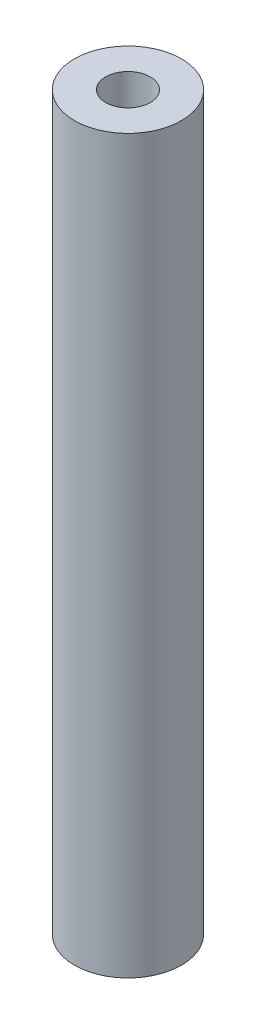
ISO-10303-21;
HEADER;
FILE_DESCRIPTION(('STEP AP214'),'2;1');
FILE_NAME('part.step','',(''),(''),'','','');
FILE_SCHEMA(('AUTOMOTIVE_DESIGN { 1 0 10303 214 1 1 1 1 }'));
ENDSEC;
DATA;
#1=APPLICATION_CONTEXT('core data for automotive mechanical design processes');
#2=APPLICATION_PROTOCOL_DEFINITION('international standard','automotive_design',2000,#1);
#3=PRODUCT_CONTEXT('',#1,'mechanical');
#4=PRODUCT('Part','Part','',(#3));
#5=PRODUCT_RELATED_PRODUCT_CATEGORY('part','',(#4));
#6=PRODUCT_DEFINITION_FORMATION('','',#4);
#7=PRODUCT_DEFINITION_CONTEXT('part definition',#1,'design');
#8=PRODUCT_DEFINITION('design','',#6,#7);
#9=PRODUCT_DEFINITION_SHAPE('','',#8);
#10=(LENGTH_UNIT() NAMED_UNIT(*) SI_UNIT(.MILLI.,.METRE.));
#11=(NAMED_UNIT(*) PLANE_ANGLE_UNIT() SI_UNIT($,.RADIAN.));
#12=(NAMED_UNIT(*) SI_UNIT($,.STERADIAN.) SOLID_ANGLE_UNIT());
#13=UNCERTAINTY_MEASURE_WITH_UNIT(LENGTH_MEASURE(1.E-05),#10,'distance_accuracy_value','');
#14=(GEOMETRIC_REPRESENTATION_CONTEXT(3) GLOBAL_UNCERTAINTY_ASSIGNED_CONTEXT((#13)) GLOBAL_UNIT_ASSIGNED_CONTEXT((#10,
#11,#12)) REPRESENTATION_CONTEXT('',''));
#15=CARTESIAN_POINT('',(0.,0.,0.));
#16=DIRECTION('',(0.,0.,1.));
#17=DIRECTION('',(1.,0.,0.));
#18=AXIS2_PLACEMENT_3D('',#15,#16,#17);
#19=CARTESIAN_POINT('',(0.,41.,0.));
#20=DIRECTION('',(0.,-1.,0.));
#21=DIRECTION('',(0.,0.,-1.));
#22=AXIS2_PLACEMENT_3D('',#19,#20,#21);
#23=CYLINDRICAL_SURFACE('',#22,3.);
#24=CARTESIAN_POINT('',(0.,41.,0.));
#25=DIRECTION('',(0.,1.,0.));
#26=DIRECTION('',(0.,0.,1.));
#27=AXIS2_PLACEMENT_3D('',#24,#25,#26);
#28=CIRCLE('',#27,3.);
#29=CARTESIAN_POINT('',(0.,41.,3.));
#30=VERTEX_POINT('',#29);
#31=EDGE_CURVE('E11',#30,#30,#28,.T.);
#32=ORIENTED_EDGE('',*,*,#31,.F.);
#33=EDGE_LOOP('',(#32));
#34=FACE_BOUND('',#33,.T.);
#35=CARTESIAN_POINT('',(0.,0.,0.));
#36=DIRECTION('',(0.,1.,0.));
#37=DIRECTION('',(0.,0.,1.));
#38=AXIS2_PLACEMENT_3D('',#35,#36,#37);
#39=CIRCLE('',#38,3.);
#40=CARTESIAN_POINT('',(0.,0.,3.));
#41=VERTEX_POINT('',#40);
#42=EDGE_CURVE('E45',#41,#41,#39,.T.);
#43=ORIENTED_EDGE('',*,*,#42,.T.);
#44=EDGE_LOOP('',(#43));
#45=FACE_BOUND('',#44,.T.);
#46=ADVANCED_FACE('F42',(#34,#45),#23,.T.);
#47=CARTESIAN_POINT('',(0.,41.,0.));
#48=DIRECTION('',(0.,1.,0.));
#49=DIRECTION('',(0.,0.,1.));
#50=AXIS2_PLACEMENT_3D('',#47,#48,#49);
#51=PLANE('',#50);
#52=CARTESIAN_POINT('',(0.,41.,0.));
#53=DIRECTION('',(0.,1.,0.));
#54=DIRECTION('',(0.,0.,1.));
#55=AXIS2_PLACEMENT_3D('',#52,#53,#54);
#56=CIRCLE('',#55,1.24999999999999);
#57=CARTESIAN_POINT('',(0.,41.,1.24999999999999));
#58=VERTEX_POINT('',#57);
#59=EDGE_CURVE('E67',#58,#58,#56,.T.);
#60=ORIENTED_EDGE('',*,*,#59,.F.);
#61=EDGE_LOOP('',(#60));
#62=FACE_BOUND('',#61,.T.);
#63=ORIENTED_EDGE('',*,*,#31,.T.);
#64=EDGE_LOOP('',(#63));
#65=FACE_BOUND('',#64,.T.);
#66=ADVANCED_FACE('F90',(#62,#65),#51,.T.);
#67=CARTESIAN_POINT('',(0.,0.,0.));
#68=DIRECTION('',(0.,1.,0.));
#69=DIRECTION('',(0.,0.,1.));
#70=AXIS2_PLACEMENT_3D('',#67,#68,#69);
#71=PLANE('',#70);
#72=CARTESIAN_POINT('',(0.,0.,0.));
#73=DIRECTION('',(0.,-1.,0.));
#74=DIRECTION('',(0.,0.,-1.));
#75=AXIS2_PLACEMENT_3D('',#72,#73,#74);
#76=CIRCLE('',#75,1.24999999999999);
#77=CARTESIAN_POINT('',(0.,0.,-1.24999999999999));
#78=VERTEX_POINT('',#77);
#79=EDGE_CURVE('E68',#78,#78,#76,.T.);
#80=ORIENTED_EDGE('',*,*,#79,.F.);
#81=EDGE_LOOP('',(#80));
#82=FACE_BOUND('',#81,.T.);
#83=ORIENTED_EDGE('',*,*,#42,.F.);
#84=EDGE_LOOP('',(#83));
#85=FACE_BOUND('',#84,.T.);
#86=ADVANCED_FACE('F87',(#82,#85),#71,.F.);
#87=CARTESIAN_POINT('',(0.,32.5,0.));
#88=DIRECTION('',(0.,1.,0.));
#89=DIRECTION('',(0.,0.,1.));
#90=AXIS2_PLACEMENT_3D('',#87,#88,#89);
#91=CONICAL_SURFACE('',#90,1.25,1.02974425867665);
#92=CARTESIAN_POINT('',(0.,31.7489242262155,0.));
#93=VERTEX_POINT('',#92);
#94=VERTEX_LOOP('',#93);
#95=FACE_BOUND('',#94,.T.);
#96=CARTESIAN_POINT('',(0.,32.5,0.));
#97=DIRECTION('',(0.,1.,0.));
#98=DIRECTION('',(0.,0.,1.));
#99=AXIS2_PLACEMENT_3D('',#96,#97,#98);
#100=CIRCLE('',#99,1.25);
#101=CARTESIAN_POINT('',(0.,32.5,1.25));
#102=VERTEX_POINT('',#101);
#103=EDGE_CURVE('E73',#102,#102,#100,.T.);
#104=ORIENTED_EDGE('',*,*,#103,.T.);
#105=EDGE_LOOP('',(#104));
#106=FACE_BOUND('',#105,.T.);
#107=ADVANCED_FACE('F89',(#95,#106),#91,.F.);
#108=CARTESIAN_POINT('',(0.,41.,0.));
#109=DIRECTION('',(0.,1.,0.));
#110=DIRECTION('',(0.,0.,1.));
#111=AXIS2_PLACEMENT_3D('',#108,#109,#110);
#112=CYLINDRICAL_SURFACE('',#111,1.24999999999999);
#113=ORIENTED_EDGE('',*,*,#103,.F.);
#114=EDGE_LOOP('',(#113));
#115=FACE_BOUND('',#114,.T.);
#116=ORIENTED_EDGE('',*,*,#59,.T.);
#117=EDGE_LOOP('',(#116));
#118=FACE_BOUND('',#117,.T.);
#119=ADVANCED_FACE('F60',(#115,#118),#112,.F.);
#120=CARTESIAN_POINT('',(0.,8.49999999999999,0.));
#121=DIRECTION('',(0.,-1.,0.));
#122=DIRECTION('',(0.,0.,-1.));
#123=AXIS2_PLACEMENT_3D('',#120,#121,#122);
#124=CONICAL_SURFACE('',#123,1.24999999999999,1.02974425867665);
#125=CARTESIAN_POINT('',(0.,9.25107577378444,0.));
#126=VERTEX_POINT('',#125);
#127=VERTEX_LOOP('',#126);
#128=FACE_BOUND('',#127,.T.);
#129=CARTESIAN_POINT('',(0.,8.49999999999999,0.));
#130=DIRECTION('',(0.,-1.,0.));
#131=DIRECTION('',(0.,0.,-1.));
#132=AXIS2_PLACEMENT_3D('',#129,#130,#131);
#133=CIRCLE('',#132,1.24999999999999);
#134=CARTESIAN_POINT('',(0.,8.49999999999999,-1.24999999999999));
#135=VERTEX_POINT('',#134);
#136=EDGE_CURVE('E64',#135,#135,#133,.T.);
#137=ORIENTED_EDGE('',*,*,#136,.T.);
#138=EDGE_LOOP('',(#137));
#139=FACE_BOUND('',#138,.T.);
#140=ADVANCED_FACE('F56',(#128,#139),#124,.F.);
#141=CARTESIAN_POINT('',(0.,0.,0.));
#142=DIRECTION('',(0.,-1.,0.));
#143=DIRECTION('',(0.,0.,-1.));
#144=AXIS2_PLACEMENT_3D('',#141,#142,#143);
#145=CYLINDRICAL_SURFACE('',#144,1.24999999999999);
#146=ORIENTED_EDGE('',*,*,#136,.F.);
#147=EDGE_LOOP('',(#146));
#148=FACE_BOUND('',#147,.T.);
#149=ORIENTED_EDGE('',*,*,#79,.T.);
#150=EDGE_LOOP('',(#149));
#151=FACE_BOUND('',#150,.T.);
#152=ADVANCED_FACE('F59',(#148,#151),#145,.F.);
#153=CLOSED_SHELL('',(#46,#66,#86,#107,#119,#140,#152));
#154=MANIFOLD_SOLID_BREP('B2',#153);
#155=ADVANCED_BREP_SHAPE_REPRESENTATION('',(#18,#154),#14);
#156=SHAPE_DEFINITION_REPRESENTATION(#9,#155);
ENDSEC;
END-ISO-10303-21;
